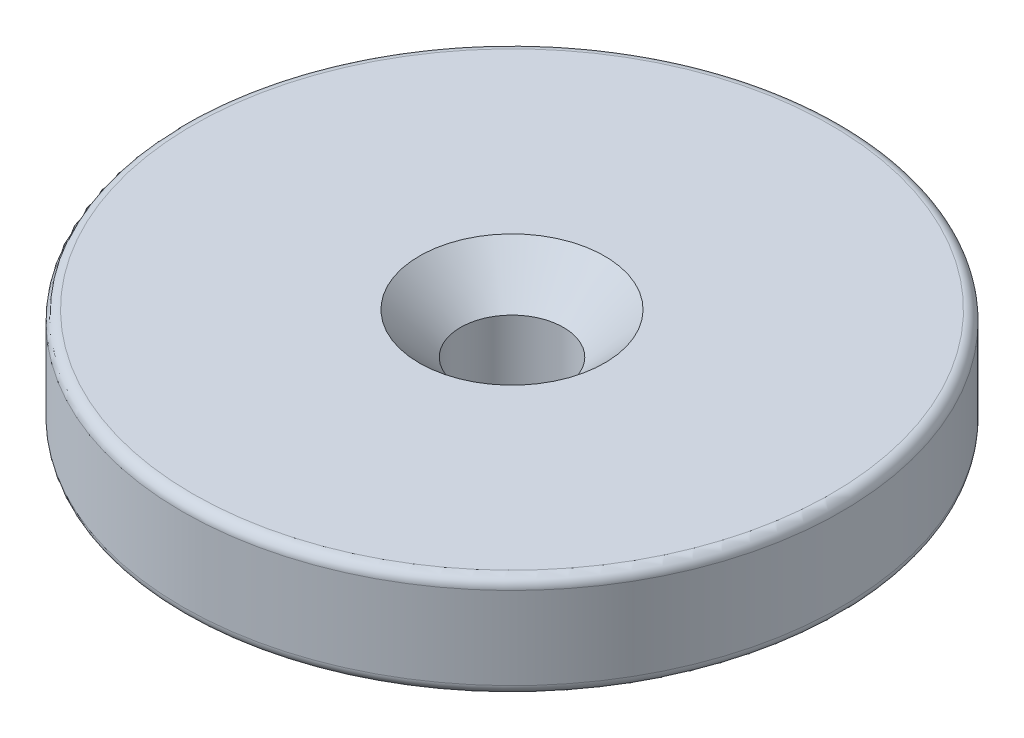
ISO-10303-21;
HEADER;
FILE_DESCRIPTION(('STEP AP214'),'2;1');
FILE_NAME('part.step','',(''),(''),'','','');
FILE_SCHEMA(('AUTOMOTIVE_DESIGN { 1 0 10303 214 1 1 1 1 }'));
ENDSEC;
DATA;
#1=APPLICATION_CONTEXT('core data for automotive mechanical design processes');
#2=APPLICATION_PROTOCOL_DEFINITION('international standard','automotive_design',2000,#1);
#3=PRODUCT_CONTEXT('',#1,'mechanical');
#4=PRODUCT('Part','Part','',(#3));
#5=PRODUCT_RELATED_PRODUCT_CATEGORY('part','',(#4));
#6=PRODUCT_DEFINITION_FORMATION('','',#4);
#7=PRODUCT_DEFINITION_CONTEXT('part definition',#1,'design');
#8=PRODUCT_DEFINITION('design','',#6,#7);
#9=PRODUCT_DEFINITION_SHAPE('','',#8);
#10=(LENGTH_UNIT() NAMED_UNIT(*) SI_UNIT(.MILLI.,.METRE.));
#11=(NAMED_UNIT(*) PLANE_ANGLE_UNIT() SI_UNIT($,.RADIAN.));
#12=(NAMED_UNIT(*) SI_UNIT($,.STERADIAN.) SOLID_ANGLE_UNIT());
#13=UNCERTAINTY_MEASURE_WITH_UNIT(LENGTH_MEASURE(1.E-05),#10,'distance_accuracy_value','');
#14=(GEOMETRIC_REPRESENTATION_CONTEXT(3) GLOBAL_UNCERTAINTY_ASSIGNED_CONTEXT((#13)) GLOBAL_UNIT_ASSIGNED_CONTEXT((#10,
#11,#12)) REPRESENTATION_CONTEXT('',''));
#15=CARTESIAN_POINT('',(0.,0.,0.));
#16=DIRECTION('',(0.,0.,1.));
#17=DIRECTION('',(1.,0.,0.));
#18=AXIS2_PLACEMENT_3D('',#15,#16,#17);
#19=CARTESIAN_POINT('',(0.,5.,0.));
#20=DIRECTION('',(0.,1.,0.));
#21=DIRECTION('',(0.,0.,1.));
#22=AXIS2_PLACEMENT_3D('',#19,#20,#21);
#23=PLANE('',#22);
#24=CARTESIAN_POINT('',(0.,5.,0.));
#25=DIRECTION('',(0.,1.,0.));
#26=DIRECTION('',(0.,0.,1.));
#27=AXIS2_PLACEMENT_3D('',#24,#25,#26);
#28=CIRCLE('',#27,15.5);
#29=CARTESIAN_POINT('',(0.,5.,15.5));
#30=VERTEX_POINT('',#29);
#31=EDGE_CURVE('E10',#30,#30,#28,.T.);
#32=ORIENTED_EDGE('',*,*,#31,.T.);
#33=EDGE_LOOP('',(#32));
#34=FACE_BOUND('',#33,.T.);
#35=CARTESIAN_POINT('',(0.,5.,0.));
#36=DIRECTION('',(0.,1.,0.));
#37=DIRECTION('',(0.,0.,1.));
#38=AXIS2_PLACEMENT_3D('',#35,#36,#37);
#39=CIRCLE('',#38,4.5);
#40=CARTESIAN_POINT('',(0.,5.,4.5));
#41=VERTEX_POINT('',#40);
#42=EDGE_CURVE('E51',#41,#41,#39,.F.);
#43=ORIENTED_EDGE('',*,*,#42,.T.);
#44=EDGE_LOOP('',(#43));
#45=FACE_BOUND('',#44,.T.);
#46=ADVANCED_FACE('F31',(#34,#45),#23,.T.);
#47=CARTESIAN_POINT('',(0.,0.,0.));
#48=DIRECTION('',(0.,1.,0.));
#49=DIRECTION('',(0.,0.,1.));
#50=AXIS2_PLACEMENT_3D('',#47,#48,#49);
#51=PLANE('',#50);
#52=CARTESIAN_POINT('',(0.,0.,0.));
#53=DIRECTION('',(0.,1.,0.));
#54=DIRECTION('',(0.,0.,1.));
#55=AXIS2_PLACEMENT_3D('',#52,#53,#54);
#56=CIRCLE('',#55,15.5);
#57=CARTESIAN_POINT('',(0.,0.,15.5));
#58=VERTEX_POINT('',#57);
#59=EDGE_CURVE('E38',#58,#58,#56,.F.);
#60=ORIENTED_EDGE('',*,*,#59,.T.);
#61=EDGE_LOOP('',(#60));
#62=FACE_BOUND('',#61,.T.);
#63=CARTESIAN_POINT('',(0.,0.,0.));
#64=DIRECTION('',(0.,1.,0.));
#65=DIRECTION('',(0.,0.,1.));
#66=AXIS2_PLACEMENT_3D('',#63,#64,#65);
#67=CIRCLE('',#66,2.5);
#68=CARTESIAN_POINT('',(0.,0.,2.5));
#69=VERTEX_POINT('',#68);
#70=EDGE_CURVE('E57',#69,#69,#67,.T.);
#71=ORIENTED_EDGE('',*,*,#70,.T.);
#72=EDGE_LOOP('',(#71));
#73=FACE_BOUND('',#72,.T.);
#74=ADVANCED_FACE('F61',(#62,#73),#51,.F.);
#75=CARTESIAN_POINT('',(0.,5.,0.));
#76=DIRECTION('',(0.,-1.,0.));
#77=DIRECTION('',(0.,0.,-1.));
#78=AXIS2_PLACEMENT_3D('',#75,#76,#77);
#79=CYLINDRICAL_SURFACE('',#78,16.);
#80=CARTESIAN_POINT('',(0.,0.5,0.));
#81=DIRECTION('',(0.,1.,0.));
#82=DIRECTION('',(0.,0.,1.));
#83=AXIS2_PLACEMENT_3D('',#80,#81,#82);
#84=CIRCLE('',#83,16.);
#85=CARTESIAN_POINT('',(0.,0.5,16.));
#86=VERTEX_POINT('',#85);
#87=EDGE_CURVE('E42',#86,#86,#84,.T.);
#88=ORIENTED_EDGE('',*,*,#87,.T.);
#89=EDGE_LOOP('',(#88));
#90=FACE_BOUND('',#89,.T.);
#91=CARTESIAN_POINT('',(0.,4.5,0.));
#92=DIRECTION('',(0.,1.,0.));
#93=DIRECTION('',(0.,0.,1.));
#94=AXIS2_PLACEMENT_3D('',#91,#92,#93);
#95=CIRCLE('',#94,16.);
#96=CARTESIAN_POINT('',(0.,4.5,16.));
#97=VERTEX_POINT('',#96);
#98=EDGE_CURVE('E46',#97,#97,#95,.F.);
#99=ORIENTED_EDGE('',*,*,#98,.T.);
#100=EDGE_LOOP('',(#99));
#101=FACE_BOUND('',#100,.T.);
#102=ADVANCED_FACE('F66',(#90,#101),#79,.T.);
#103=CARTESIAN_POINT('',(0.,5.,0.));
#104=DIRECTION('',(0.,-1.,0.));
#105=DIRECTION('',(0.,0.,-1.));
#106=AXIS2_PLACEMENT_3D('',#103,#104,#105);
#107=CYLINDRICAL_SURFACE('',#106,2.5);
#108=CARTESIAN_POINT('',(0.,3.00000000000001,0.));
#109=DIRECTION('',(0.,1.,0.));
#110=DIRECTION('',(0.,0.,1.));
#111=AXIS2_PLACEMENT_3D('',#108,#109,#110);
#112=CIRCLE('',#111,2.5);
#113=CARTESIAN_POINT('',(0.,3.00000000000001,2.5));
#114=VERTEX_POINT('',#113);
#115=EDGE_CURVE('E54',#114,#114,#112,.T.);
#116=ORIENTED_EDGE('',*,*,#115,.T.);
#117=EDGE_LOOP('',(#116));
#118=FACE_BOUND('',#117,.T.);
#119=ORIENTED_EDGE('',*,*,#70,.F.);
#120=EDGE_LOOP('',(#119));
#121=FACE_BOUND('',#120,.T.);
#122=ADVANCED_FACE('F63',(#118,#121),#107,.F.);
#123=CARTESIAN_POINT('',(0.,3.00000000000001,0.));
#124=DIRECTION('',(0.,1.,0.));
#125=DIRECTION('',(0.,0.,1.));
#126=AXIS2_PLACEMENT_3D('',#123,#124,#125);
#127=CONICAL_SURFACE('',#126,2.5,0.78539816339745);
#128=ORIENTED_EDGE('',*,*,#42,.F.);
#129=EDGE_LOOP('',(#128));
#130=FACE_BOUND('',#129,.T.);
#131=ORIENTED_EDGE('',*,*,#115,.F.);
#132=EDGE_LOOP('',(#131));
#133=FACE_BOUND('',#132,.T.);
#134=ADVANCED_FACE('F65',(#130,#133),#127,.F.);
#135=CARTESIAN_POINT('',(0.,0.5,0.));
#136=DIRECTION('',(0.,1.,0.));
#137=DIRECTION('',(0.,0.,1.));
#138=AXIS2_PLACEMENT_3D('',#135,#136,#137);
#139=TOROIDAL_SURFACE('',#138,15.5,0.5);
#140=ORIENTED_EDGE('',*,*,#59,.F.);
#141=EDGE_LOOP('',(#140));
#142=FACE_BOUND('',#141,.T.);
#143=ORIENTED_EDGE('',*,*,#87,.F.);
#144=EDGE_LOOP('',(#143));
#145=FACE_BOUND('',#144,.T.);
#146=ADVANCED_FACE('F73',(#142,#145),#139,.T.);
#147=CARTESIAN_POINT('',(0.,4.5,0.));
#148=DIRECTION('',(0.,1.,0.));
#149=DIRECTION('',(0.,0.,1.));
#150=AXIS2_PLACEMENT_3D('',#147,#148,#149);
#151=TOROIDAL_SURFACE('',#150,15.5,0.5);
#152=ORIENTED_EDGE('',*,*,#98,.F.);
#153=EDGE_LOOP('',(#152));
#154=FACE_BOUND('',#153,.T.);
#155=ORIENTED_EDGE('',*,*,#31,.F.);
#156=EDGE_LOOP('',(#155));
#157=FACE_BOUND('',#156,.T.);
#158=ADVANCED_FACE('F33',(#154,#157),#151,.T.);
#159=CLOSED_SHELL('',(#46,#74,#102,#122,#134,#146,#158));
#160=MANIFOLD_SOLID_BREP('B2',#159);
#161=ADVANCED_BREP_SHAPE_REPRESENTATION('',(#18,#160),#14);
#162=SHAPE_DEFINITION_REPRESENTATION(#9,#161);
ENDSEC;
END-ISO-10303-21;
